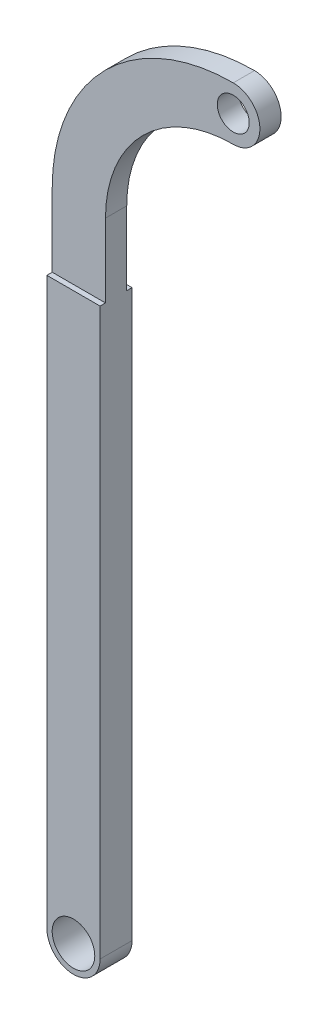
ISO-10303-21;
HEADER;
FILE_DESCRIPTION(('STEP AP214'),'2;1');
FILE_NAME('part.step','',(''),(''),'','','');
FILE_SCHEMA(('AUTOMOTIVE_DESIGN { 1 0 10303 214 1 1 1 1 }'));
ENDSEC;
DATA;
#1=APPLICATION_CONTEXT('core data for automotive mechanical design processes');
#2=APPLICATION_PROTOCOL_DEFINITION('international standard','automotive_design',2000,#1);
#3=PRODUCT_CONTEXT('',#1,'mechanical');
#4=PRODUCT('Part','Part','',(#3));
#5=PRODUCT_RELATED_PRODUCT_CATEGORY('part','',(#4));
#6=PRODUCT_DEFINITION_FORMATION('','',#4);
#7=PRODUCT_DEFINITION_CONTEXT('part definition',#1,'design');
#8=PRODUCT_DEFINITION('design','',#6,#7);
#9=PRODUCT_DEFINITION_SHAPE('','',#8);
#10=(LENGTH_UNIT() NAMED_UNIT(*) SI_UNIT(.MILLI.,.METRE.));
#11=(NAMED_UNIT(*) PLANE_ANGLE_UNIT() SI_UNIT($,.RADIAN.));
#12=(NAMED_UNIT(*) SI_UNIT($,.STERADIAN.) SOLID_ANGLE_UNIT());
#13=UNCERTAINTY_MEASURE_WITH_UNIT(LENGTH_MEASURE(1.E-05),#10,'distance_accuracy_value','');
#14=(GEOMETRIC_REPRESENTATION_CONTEXT(3) GLOBAL_UNCERTAINTY_ASSIGNED_CONTEXT((#13)) GLOBAL_UNIT_ASSIGNED_CONTEXT((#10,
#11,#12)) REPRESENTATION_CONTEXT('',''));
#15=CARTESIAN_POINT('',(0.,0.,0.));
#16=DIRECTION('',(0.,0.,1.));
#17=DIRECTION('',(1.,0.,0.));
#18=AXIS2_PLACEMENT_3D('',#15,#16,#17);
#19=CARTESIAN_POINT('',(0.,0.,3.));
#20=DIRECTION('',(0.,0.,1.));
#21=DIRECTION('',(1.,0.,0.));
#22=AXIS2_PLACEMENT_3D('',#19,#20,#21);
#23=PLANE('',#22);
#24=DIRECTION('',(1.,0.,0.));
#25=VECTOR('',#24,1.);
#26=CARTESIAN_POINT('',(0.,53.1000544495774,3.));
#27=LINE('',#26,#25);
#28=CARTESIAN_POINT('',(-2.5,53.1000544495774,3.));
#29=VERTEX_POINT('',#28);
#30=CARTESIAN_POINT('',(2.5,53.1000544495774,3.));
#31=VERTEX_POINT('',#30);
#32=EDGE_CURVE('E192',#29,#31,#27,.T.);
#33=ORIENTED_EDGE('',*,*,#32,.F.);
#34=DIRECTION('',(0.,-1.,0.));
#35=VECTOR('',#34,1.);
#36=CARTESIAN_POINT('',(-2.5,0.,3.));
#37=LINE('',#36,#35);
#38=CARTESIAN_POINT('',(-2.5,0.,3.));
#39=VERTEX_POINT('',#38);
#40=EDGE_CURVE('E148',#29,#39,#37,.T.);
#41=ORIENTED_EDGE('',*,*,#40,.T.);
#42=CARTESIAN_POINT('',(0.,0.,3.));
#43=DIRECTION('',(0.,0.,1.));
#44=DIRECTION('',(1.,0.,0.));
#45=AXIS2_PLACEMENT_3D('',#42,#43,#44);
#46=CIRCLE('',#45,2.5);
#47=CARTESIAN_POINT('',(2.5,0.,3.));
#48=VERTEX_POINT('',#47);
#49=EDGE_CURVE('E136',#39,#48,#46,.T.);
#50=ORIENTED_EDGE('',*,*,#49,.T.);
#51=DIRECTION('',(0.,1.,0.));
#52=VECTOR('',#51,1.);
#53=CARTESIAN_POINT('',(2.5,0.,3.));
#54=LINE('',#53,#52);
#55=EDGE_CURVE('E140',#48,#31,#54,.T.);
#56=ORIENTED_EDGE('',*,*,#55,.T.);
#57=EDGE_LOOP('',(#33,#41,#50,#56));
#58=FACE_BOUND('',#57,.T.);
#59=CARTESIAN_POINT('',(0.,0.,3.));
#60=DIRECTION('',(0.,0.,1.));
#61=DIRECTION('',(1.,0.,0.));
#62=AXIS2_PLACEMENT_3D('',#59,#60,#61);
#63=CIRCLE('',#62,2.);
#64=CARTESIAN_POINT('',(2.,0.,3.));
#65=VERTEX_POINT('',#64);
#66=EDGE_CURVE('E196',#65,#65,#63,.T.);
#67=ORIENTED_EDGE('',*,*,#66,.F.);
#68=EDGE_LOOP('',(#67));
#69=FACE_BOUND('',#68,.T.);
#70=ADVANCED_FACE('F35',(#58,#69),#23,.T.);
#71=CARTESIAN_POINT('',(0.,0.,0.));
#72=DIRECTION('',(0.,0.,1.));
#73=DIRECTION('',(1.,0.,0.));
#74=AXIS2_PLACEMENT_3D('',#71,#72,#73);
#75=PLANE('',#74);
#76=DIRECTION('',(0.,-1.,0.));
#77=VECTOR('',#76,1.);
#78=CARTESIAN_POINT('',(-2.5,0.,0.));
#79=LINE('',#78,#77);
#80=CARTESIAN_POINT('',(-2.5,53.1000544495774,0.));
#81=VERTEX_POINT('',#80);
#82=CARTESIAN_POINT('',(-2.5,0.,0.));
#83=VERTEX_POINT('',#82);
#84=EDGE_CURVE('E126',#81,#83,#79,.T.);
#85=ORIENTED_EDGE('',*,*,#84,.F.);
#86=DIRECTION('',(1.,0.,0.));
#87=VECTOR('',#86,1.);
#88=CARTESIAN_POINT('',(-2.5,53.1000544495774,0.));
#89=LINE('',#88,#87);
#90=CARTESIAN_POINT('',(2.5,53.1000544495774,0.));
#91=VERTEX_POINT('',#90);
#92=EDGE_CURVE('E112',#81,#91,#89,.T.);
#93=ORIENTED_EDGE('',*,*,#92,.T.);
#94=DIRECTION('',(0.,1.,0.));
#95=VECTOR('',#94,1.);
#96=CARTESIAN_POINT('',(2.5,0.,0.));
#97=LINE('',#96,#95);
#98=CARTESIAN_POINT('',(2.5,0.,0.));
#99=VERTEX_POINT('',#98);
#100=EDGE_CURVE('E137',#99,#91,#97,.T.);
#101=ORIENTED_EDGE('',*,*,#100,.F.);
#102=CARTESIAN_POINT('',(0.,0.,0.));
#103=DIRECTION('',(0.,0.,1.));
#104=DIRECTION('',(1.,0.,0.));
#105=AXIS2_PLACEMENT_3D('',#102,#103,#104);
#106=CIRCLE('',#105,2.5);
#107=EDGE_CURVE('E135',#83,#99,#106,.T.);
#108=ORIENTED_EDGE('',*,*,#107,.F.);
#109=EDGE_LOOP('',(#85,#93,#101,#108));
#110=FACE_BOUND('',#109,.T.);
#111=CARTESIAN_POINT('',(0.,0.,0.));
#112=DIRECTION('',(0.,0.,1.));
#113=DIRECTION('',(1.,0.,0.));
#114=AXIS2_PLACEMENT_3D('',#111,#112,#113);
#115=CIRCLE('',#114,2.);
#116=CARTESIAN_POINT('',(2.,0.,0.));
#117=VERTEX_POINT('',#116);
#118=EDGE_CURVE('E195',#117,#117,#115,.T.);
#119=ORIENTED_EDGE('',*,*,#118,.T.);
#120=EDGE_LOOP('',(#119));
#121=FACE_BOUND('',#120,.T.);
#122=ADVANCED_FACE('F132',(#110,#121),#75,.F.);
#123=CARTESIAN_POINT('',(0.,0.,3.));
#124=DIRECTION('',(0.,0.,-1.));
#125=DIRECTION('',(-1.,0.,0.));
#126=AXIS2_PLACEMENT_3D('',#123,#124,#125);
#127=CYLINDRICAL_SURFACE('',#126,2.5);
#128=ORIENTED_EDGE('',*,*,#107,.T.);
#129=DIRECTION('',(0.,0.,-1.));
#130=VECTOR('',#129,1.);
#131=CARTESIAN_POINT('',(2.5,0.,3.));
#132=LINE('',#131,#130);
#133=EDGE_CURVE('E43',#48,#99,#132,.T.);
#134=ORIENTED_EDGE('',*,*,#133,.F.);
#135=ORIENTED_EDGE('',*,*,#49,.F.);
#136=DIRECTION('',(0.,0.,-1.));
#137=VECTOR('',#136,1.);
#138=CARTESIAN_POINT('',(-2.5,0.,3.));
#139=LINE('',#138,#137);
#140=EDGE_CURVE('E145',#39,#83,#139,.T.);
#141=ORIENTED_EDGE('',*,*,#140,.T.);
#142=EDGE_LOOP('',(#128,#134,#135,#141));
#143=FACE_BOUND('',#142,.T.);
#144=ADVANCED_FACE('F37',(#143),#127,.T.);
#145=CARTESIAN_POINT('',(2.5,0.,3.));
#146=DIRECTION('',(-1.,0.,0.));
#147=DIRECTION('',(0.,-1.,0.));
#148=AXIS2_PLACEMENT_3D('',#145,#146,#147);
#149=PLANE('',#148);
#150=ORIENTED_EDGE('',*,*,#100,.T.);
#151=DIRECTION('',(0.,0.,1.));
#152=VECTOR('',#151,1.);
#153=CARTESIAN_POINT('',(2.5,53.1000544495774,3.));
#154=LINE('',#153,#152);
#155=CARTESIAN_POINT('',(2.5,53.1000544495774,0.499999999999998));
#156=VERTEX_POINT('',#155);
#157=EDGE_CURVE('E115',#91,#156,#154,.T.);
#158=ORIENTED_EDGE('',*,*,#157,.T.);
#159=DIRECTION('',(0.,1.,0.));
#160=VECTOR('',#159,1.);
#161=CARTESIAN_POINT('',(2.5,0.,0.499999999999994));
#162=LINE('',#161,#160);
#163=CARTESIAN_POINT('',(2.5,60.,0.499999999999999));
#164=VERTEX_POINT('',#163);
#165=EDGE_CURVE('E187',#156,#164,#162,.T.);
#166=ORIENTED_EDGE('',*,*,#165,.T.);
#167=DIRECTION('',(0.,0.,-1.));
#168=VECTOR('',#167,1.);
#169=CARTESIAN_POINT('',(2.5,60.,3.));
#170=LINE('',#169,#168);
#171=CARTESIAN_POINT('',(2.5,60.,2.49525425296521));
#172=VERTEX_POINT('',#171);
#173=EDGE_CURVE('E156',#172,#164,#170,.T.);
#174=ORIENTED_EDGE('',*,*,#173,.F.);
#175=DIRECTION('',(0.,-1.,0.));
#176=VECTOR('',#175,1.);
#177=CARTESIAN_POINT('',(2.5,0.,2.49525425296521));
#178=LINE('',#177,#176);
#179=CARTESIAN_POINT('',(2.5,53.1000544495774,2.49525425296521));
#180=VERTEX_POINT('',#179);
#181=EDGE_CURVE('E166',#172,#180,#178,.T.);
#182=ORIENTED_EDGE('',*,*,#181,.T.);
#183=DIRECTION('',(0.,0.,1.));
#184=VECTOR('',#183,1.);
#185=CARTESIAN_POINT('',(2.5,53.1000544495774,3.));
#186=LINE('',#185,#184);
#187=EDGE_CURVE('E190',#180,#31,#186,.T.);
#188=ORIENTED_EDGE('',*,*,#187,.T.);
#189=ORIENTED_EDGE('',*,*,#55,.F.);
#190=ORIENTED_EDGE('',*,*,#133,.T.);
#191=EDGE_LOOP('',(#150,#158,#166,#174,#182,#188,#189,#190));
#192=FACE_BOUND('',#191,.T.);
#193=ADVANCED_FACE('F212',(#192),#149,.F.);
#194=CARTESIAN_POINT('',(14.5,60.,3.));
#195=DIRECTION('',(0.,0.,-1.));
#196=DIRECTION('',(-1.,0.,0.));
#197=AXIS2_PLACEMENT_3D('',#194,#195,#196);
#198=CYLINDRICAL_SURFACE('',#197,12.);
#199=ORIENTED_EDGE('',*,*,#173,.T.);
#200=CARTESIAN_POINT('',(14.5,60.,0.499999999999999));
#201=DIRECTION('',(0.,0.,1.));
#202=DIRECTION('',(0.,-1.,0.));
#203=AXIS2_PLACEMENT_3D('',#200,#201,#202);
#204=CIRCLE('',#203,12.);
#205=CARTESIAN_POINT('',(14.5,72.,0.5));
#206=VERTEX_POINT('',#205);
#207=EDGE_CURVE('E184',#164,#206,#204,.F.);
#208=ORIENTED_EDGE('',*,*,#207,.T.);
#209=DIRECTION('',(0.,0.,-1.));
#210=VECTOR('',#209,1.);
#211=CARTESIAN_POINT('',(14.5,72.,3.));
#212=LINE('',#211,#210);
#213=CARTESIAN_POINT('',(14.5,72.,2.49525425296521));
#214=VERTEX_POINT('',#213);
#215=EDGE_CURVE('E153',#214,#206,#212,.T.);
#216=ORIENTED_EDGE('',*,*,#215,.F.);
#217=CARTESIAN_POINT('',(14.5,60.,2.49525425296521));
#218=DIRECTION('',(0.,0.,-1.));
#219=DIRECTION('',(-1.,0.,0.));
#220=AXIS2_PLACEMENT_3D('',#217,#218,#219);
#221=CIRCLE('',#220,12.);
#222=EDGE_CURVE('E173',#214,#172,#221,.F.);
#223=ORIENTED_EDGE('',*,*,#222,.T.);
#224=EDGE_LOOP('',(#199,#208,#216,#223));
#225=FACE_BOUND('',#224,.T.);
#226=ADVANCED_FACE('F215',(#225),#198,.F.);
#227=CARTESIAN_POINT('',(14.5,74.5,3.));
#228=DIRECTION('',(0.,0.,-1.));
#229=DIRECTION('',(-1.,0.,0.));
#230=AXIS2_PLACEMENT_3D('',#227,#228,#229);
#231=CYLINDRICAL_SURFACE('',#230,2.5);
#232=CARTESIAN_POINT('',(14.5,74.5,0.5));
#233=DIRECTION('',(0.,0.,1.));
#234=DIRECTION('',(0.,-1.,0.));
#235=AXIS2_PLACEMENT_3D('',#232,#233,#234);
#236=CIRCLE('',#235,2.5);
#237=CARTESIAN_POINT('',(14.5,77.,0.5));
#238=VERTEX_POINT('',#237);
#239=EDGE_CURVE('E170',#206,#238,#236,.T.);
#240=ORIENTED_EDGE('',*,*,#239,.T.);
#241=DIRECTION('',(0.,0.,-1.));
#242=VECTOR('',#241,1.);
#243=CARTESIAN_POINT('',(14.5,77.,3.));
#244=LINE('',#243,#242);
#245=CARTESIAN_POINT('',(14.5,77.,2.49525425296521));
#246=VERTEX_POINT('',#245);
#247=EDGE_CURVE('E150',#246,#238,#244,.T.);
#248=ORIENTED_EDGE('',*,*,#247,.F.);
#249=CARTESIAN_POINT('',(14.5,74.5,2.49525425296521));
#250=DIRECTION('',(0.,0.,-1.));
#251=DIRECTION('',(-1.,0.,0.));
#252=AXIS2_PLACEMENT_3D('',#249,#250,#251);
#253=CIRCLE('',#252,2.5);
#254=EDGE_CURVE('E179',#246,#214,#253,.T.);
#255=ORIENTED_EDGE('',*,*,#254,.T.);
#256=ORIENTED_EDGE('',*,*,#215,.T.);
#257=EDGE_LOOP('',(#240,#248,#255,#256));
#258=FACE_BOUND('',#257,.T.);
#259=ADVANCED_FACE('F228',(#258),#231,.T.);
#260=CARTESIAN_POINT('',(14.5,60.,3.));
#261=DIRECTION('',(0.,0.,-1.));
#262=DIRECTION('',(-1.,0.,0.));
#263=AXIS2_PLACEMENT_3D('',#260,#261,#262);
#264=CYLINDRICAL_SURFACE('',#263,17.);
#265=ORIENTED_EDGE('',*,*,#247,.T.);
#266=CARTESIAN_POINT('',(14.5,60.,0.499999999999999));
#267=DIRECTION('',(0.,0.,1.));
#268=DIRECTION('',(0.,-1.,0.));
#269=AXIS2_PLACEMENT_3D('',#266,#267,#268);
#270=CIRCLE('',#269,17.);
#271=CARTESIAN_POINT('',(-2.5,60.,0.499999999999999));
#272=VERTEX_POINT('',#271);
#273=EDGE_CURVE('E165',#238,#272,#270,.T.);
#274=ORIENTED_EDGE('',*,*,#273,.T.);
#275=DIRECTION('',(0.,0.,-1.));
#276=VECTOR('',#275,1.);
#277=CARTESIAN_POINT('',(-2.5,60.,3.));
#278=LINE('',#277,#276);
#279=CARTESIAN_POINT('',(-2.5,60.,2.49525425296521));
#280=VERTEX_POINT('',#279);
#281=EDGE_CURVE('E147',#280,#272,#278,.T.);
#282=ORIENTED_EDGE('',*,*,#281,.F.);
#283=CARTESIAN_POINT('',(14.5,60.,2.49525425296521));
#284=DIRECTION('',(0.,0.,-1.));
#285=DIRECTION('',(-1.,0.,0.));
#286=AXIS2_PLACEMENT_3D('',#283,#284,#285);
#287=CIRCLE('',#286,17.);
#288=EDGE_CURVE('E162',#280,#246,#287,.T.);
#289=ORIENTED_EDGE('',*,*,#288,.T.);
#290=EDGE_LOOP('',(#265,#274,#282,#289));
#291=FACE_BOUND('',#290,.T.);
#292=ADVANCED_FACE('F231',(#291),#264,.T.);
#293=CARTESIAN_POINT('',(-2.5,0.,3.));
#294=DIRECTION('',(1.,0.,0.));
#295=DIRECTION('',(0.,1.,0.));
#296=AXIS2_PLACEMENT_3D('',#293,#294,#295);
#297=PLANE('',#296);
#298=DIRECTION('',(0.,-1.,0.));
#299=VECTOR('',#298,1.);
#300=CARTESIAN_POINT('',(-2.5,77.,0.5));
#301=LINE('',#300,#299);
#302=CARTESIAN_POINT('',(-2.5,53.1000544495774,0.499999999999998));
#303=VERTEX_POINT('',#302);
#304=EDGE_CURVE('E129',#272,#303,#301,.T.);
#305=ORIENTED_EDGE('',*,*,#304,.T.);
#306=DIRECTION('',(0.,0.,-1.));
#307=VECTOR('',#306,1.);
#308=CARTESIAN_POINT('',(-2.5,53.1000544495774,0.499999999999998));
#309=LINE('',#308,#307);
#310=EDGE_CURVE('E50',#303,#81,#309,.T.);
#311=ORIENTED_EDGE('',*,*,#310,.T.);
#312=ORIENTED_EDGE('',*,*,#84,.T.);
#313=ORIENTED_EDGE('',*,*,#140,.F.);
#314=ORIENTED_EDGE('',*,*,#40,.F.);
#315=DIRECTION('',(0.,0.,-1.));
#316=VECTOR('',#315,1.);
#317=CARTESIAN_POINT('',(-2.5,53.1000544495774,3.));
#318=LINE('',#317,#316);
#319=CARTESIAN_POINT('',(-2.5,53.1000544495774,2.49525425296521));
#320=VERTEX_POINT('',#319);
#321=EDGE_CURVE('E11',#29,#320,#318,.T.);
#322=ORIENTED_EDGE('',*,*,#321,.T.);
#323=DIRECTION('',(0.,1.,0.));
#324=VECTOR('',#323,1.);
#325=CARTESIAN_POINT('',(-2.5,53.1000544495774,2.49525425296521));
#326=LINE('',#325,#324);
#327=EDGE_CURVE('E58',#320,#280,#326,.T.);
#328=ORIENTED_EDGE('',*,*,#327,.T.);
#329=ORIENTED_EDGE('',*,*,#281,.T.);
#330=EDGE_LOOP('',(#305,#311,#312,#313,#314,#322,#328,#329));
#331=FACE_BOUND('',#330,.T.);
#332=ADVANCED_FACE('F124',(#331),#297,.F.);
#333=CARTESIAN_POINT('',(0.,0.,3.));
#334=DIRECTION('',(0.,0.,-1.));
#335=DIRECTION('',(-1.,0.,0.));
#336=AXIS2_PLACEMENT_3D('',#333,#334,#335);
#337=CYLINDRICAL_SURFACE('',#336,2.);
#338=ORIENTED_EDGE('',*,*,#66,.T.);
#339=EDGE_LOOP('',(#338));
#340=FACE_BOUND('',#339,.T.);
#341=ORIENTED_EDGE('',*,*,#118,.F.);
#342=EDGE_LOOP('',(#341));
#343=FACE_BOUND('',#342,.T.);
#344=ADVANCED_FACE('F252',(#340,#343),#337,.F.);
#345=CARTESIAN_POINT('',(-2.5,53.1000544495774,2.49525425296521));
#346=DIRECTION('',(0.,0.,-1.));
#347=DIRECTION('',(-1.,0.,0.));
#348=AXIS2_PLACEMENT_3D('',#345,#346,#347);
#349=PLANE('',#348);
#350=CARTESIAN_POINT('',(14.5,74.5,2.49525425296521));
#351=DIRECTION('',(0.,0.,-1.));
#352=DIRECTION('',(-1.,0.,0.));
#353=AXIS2_PLACEMENT_3D('',#350,#351,#352);
#354=CIRCLE('',#353,1.5);
#355=CARTESIAN_POINT('',(13.,74.5,2.49525425296521));
#356=VERTEX_POINT('',#355);
#357=EDGE_CURVE('E119',#356,#356,#354,.T.);
#358=ORIENTED_EDGE('',*,*,#357,.T.);
#359=EDGE_LOOP('',(#358));
#360=FACE_BOUND('',#359,.T.);
#361=ORIENTED_EDGE('',*,*,#222,.F.);
#362=ORIENTED_EDGE('',*,*,#254,.F.);
#363=ORIENTED_EDGE('',*,*,#288,.F.);
#364=ORIENTED_EDGE('',*,*,#327,.F.);
#365=DIRECTION('',(1.,0.,0.));
#366=VECTOR('',#365,1.);
#367=CARTESIAN_POINT('',(-2.5,53.1000544495774,2.49525425296521));
#368=LINE('',#367,#366);
#369=EDGE_CURVE('E220',#320,#180,#368,.T.);
#370=ORIENTED_EDGE('',*,*,#369,.T.);
#371=ORIENTED_EDGE('',*,*,#181,.F.);
#372=EDGE_LOOP('',(#361,#362,#363,#364,#370,#371));
#373=FACE_BOUND('',#372,.T.);
#374=ADVANCED_FACE('F218',(#360,#373),#349,.F.);
#375=CARTESIAN_POINT('',(-2.5,53.1000544495774,3.08483516891629));
#376=DIRECTION('',(0.,-1.,0.));
#377=DIRECTION('',(0.,0.,-1.));
#378=AXIS2_PLACEMENT_3D('',#375,#376,#377);
#379=PLANE('',#378);
#380=ORIENTED_EDGE('',*,*,#32,.T.);
#381=ORIENTED_EDGE('',*,*,#187,.F.);
#382=ORIENTED_EDGE('',*,*,#369,.F.);
#383=ORIENTED_EDGE('',*,*,#321,.F.);
#384=EDGE_LOOP('',(#380,#381,#382,#383));
#385=FACE_BOUND('',#384,.T.);
#386=ADVANCED_FACE('F211',(#385),#379,.F.);
#387=CARTESIAN_POINT('',(-2.5,53.1000544495774,0.499999999999998));
#388=DIRECTION('',(0.,-1.,0.));
#389=DIRECTION('',(0.,0.,-1.));
#390=AXIS2_PLACEMENT_3D('',#387,#388,#389);
#391=PLANE('',#390);
#392=ORIENTED_EDGE('',*,*,#92,.F.);
#393=ORIENTED_EDGE('',*,*,#310,.F.);
#394=DIRECTION('',(1.,0.,0.));
#395=VECTOR('',#394,1.);
#396=CARTESIAN_POINT('',(-2.5,53.1000544495774,0.499999999999998));
#397=LINE('',#396,#395);
#398=EDGE_CURVE('E120',#303,#156,#397,.T.);
#399=ORIENTED_EDGE('',*,*,#398,.T.);
#400=ORIENTED_EDGE('',*,*,#157,.F.);
#401=EDGE_LOOP('',(#392,#393,#399,#400));
#402=FACE_BOUND('',#401,.T.);
#403=ADVANCED_FACE('F113',(#402),#391,.F.);
#404=CARTESIAN_POINT('',(-2.5,77.,0.5));
#405=DIRECTION('',(0.,0.,1.));
#406=DIRECTION('',(0.,-1.,0.));
#407=AXIS2_PLACEMENT_3D('',#404,#405,#406);
#408=PLANE('',#407);
#409=CARTESIAN_POINT('',(14.5,74.5,0.5));
#410=DIRECTION('',(0.,0.,1.));
#411=DIRECTION('',(0.,-1.,0.));
#412=AXIS2_PLACEMENT_3D('',#409,#410,#411);
#413=CIRCLE('',#412,1.5);
#414=CARTESIAN_POINT('',(14.5,73.,0.5));
#415=VERTEX_POINT('',#414);
#416=EDGE_CURVE('E163',#415,#415,#413,.T.);
#417=ORIENTED_EDGE('',*,*,#416,.T.);
#418=EDGE_LOOP('',(#417));
#419=FACE_BOUND('',#418,.T.);
#420=ORIENTED_EDGE('',*,*,#398,.F.);
#421=ORIENTED_EDGE('',*,*,#304,.F.);
#422=ORIENTED_EDGE('',*,*,#273,.F.);
#423=ORIENTED_EDGE('',*,*,#239,.F.);
#424=ORIENTED_EDGE('',*,*,#207,.F.);
#425=ORIENTED_EDGE('',*,*,#165,.F.);
#426=EDGE_LOOP('',(#420,#421,#422,#423,#424,#425));
#427=FACE_BOUND('',#426,.T.);
#428=ADVANCED_FACE('F233',(#419,#427),#408,.F.);
#429=CARTESIAN_POINT('',(14.5,74.5,3.));
#430=DIRECTION('',(0.,0.,-1.));
#431=DIRECTION('',(-1.,0.,0.));
#432=AXIS2_PLACEMENT_3D('',#429,#430,#431);
#433=CYLINDRICAL_SURFACE('',#432,1.5);
#434=ORIENTED_EDGE('',*,*,#416,.F.);
#435=EDGE_LOOP('',(#434));
#436=FACE_BOUND('',#435,.T.);
#437=ORIENTED_EDGE('',*,*,#357,.F.);
#438=EDGE_LOOP('',(#437));
#439=FACE_BOUND('',#438,.T.);
#440=ADVANCED_FACE('F235',(#436,#439),#433,.F.);
#441=CLOSED_SHELL('',(#70,#122,#144,#193,#226,#259,#292,#332,#344,#374,#386,#403,#428,#440));
#442=MANIFOLD_SOLID_BREP('B2',#441);
#443=ADVANCED_BREP_SHAPE_REPRESENTATION('',(#18,#442),#14);
#444=SHAPE_DEFINITION_REPRESENTATION(#9,#443);
ENDSEC;
END-ISO-10303-21;
